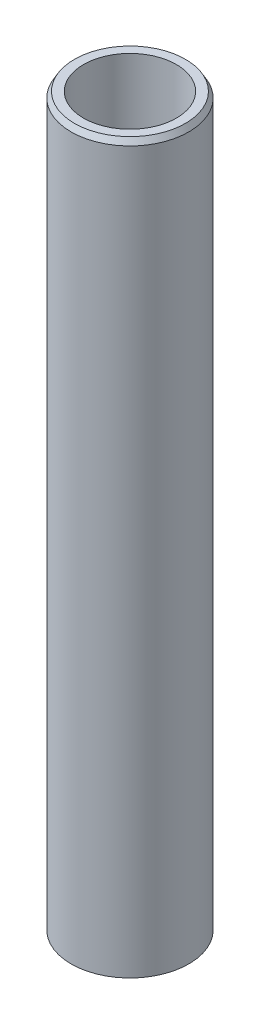
ISO-10303-21;
HEADER;
FILE_DESCRIPTION(('STEP AP214'),'2;1');
FILE_NAME('part.step','',(''),(''),'','','');
FILE_SCHEMA(('AUTOMOTIVE_DESIGN { 1 0 10303 214 1 1 1 1 }'));
ENDSEC;
DATA;
#1=APPLICATION_CONTEXT('core data for automotive mechanical design processes');
#2=APPLICATION_PROTOCOL_DEFINITION('international standard','automotive_design',2000,#1);
#3=PRODUCT_CONTEXT('',#1,'mechanical');
#4=PRODUCT('Part','Part','',(#3));
#5=PRODUCT_RELATED_PRODUCT_CATEGORY('part','',(#4));
#6=PRODUCT_DEFINITION_FORMATION('','',#4);
#7=PRODUCT_DEFINITION_CONTEXT('part definition',#1,'design');
#8=PRODUCT_DEFINITION('design','',#6,#7);
#9=PRODUCT_DEFINITION_SHAPE('','',#8);
#10=(LENGTH_UNIT() NAMED_UNIT(*) SI_UNIT(.MILLI.,.METRE.));
#11=(NAMED_UNIT(*) PLANE_ANGLE_UNIT() SI_UNIT($,.RADIAN.));
#12=(NAMED_UNIT(*) SI_UNIT($,.STERADIAN.) SOLID_ANGLE_UNIT());
#13=UNCERTAINTY_MEASURE_WITH_UNIT(LENGTH_MEASURE(1.E-05),#10,'distance_accuracy_value','');
#14=(GEOMETRIC_REPRESENTATION_CONTEXT(3) GLOBAL_UNCERTAINTY_ASSIGNED_CONTEXT((#13)) GLOBAL_UNIT_ASSIGNED_CONTEXT((#10,
#11,#12)) REPRESENTATION_CONTEXT('',''));
#15=CARTESIAN_POINT('',(0.,0.,0.));
#16=DIRECTION('',(0.,0.,1.));
#17=DIRECTION('',(1.,0.,0.));
#18=AXIS2_PLACEMENT_3D('',#15,#16,#17);
#19=CARTESIAN_POINT('',(0.,403.028937899505,0.));
#20=DIRECTION('',(0.,-1.,0.));
#21=DIRECTION('',(0.,0.,-1.));
#22=AXIS2_PLACEMENT_3D('',#19,#20,#21);
#23=CYLINDRICAL_SURFACE('',#22,32.5);
#24=CARTESIAN_POINT('',(0.,399.853276000623,0.));
#25=DIRECTION('',(0.,1.,0.));
#26=DIRECTION('',(0.,0.,1.));
#27=AXIS2_PLACEMENT_3D('',#24,#25,#26);
#28=CIRCLE('',#27,32.5);
#29=CARTESIAN_POINT('',(0.,399.853276000623,32.5));
#30=VERTEX_POINT('',#29);
#31=EDGE_CURVE('E50',#30,#30,#28,.F.);
#32=ORIENTED_EDGE('',*,*,#31,.T.);
#33=EDGE_LOOP('',(#32));
#34=FACE_BOUND('',#33,.T.);
#35=CARTESIAN_POINT('',(0.,1.83346925217448,0.));
#36=DIRECTION('',(0.,1.,0.));
#37=DIRECTION('',(0.,0.,1.));
#38=AXIS2_PLACEMENT_3D('',#35,#36,#37);
#39=CIRCLE('',#38,32.5);
#40=CARTESIAN_POINT('',(0.,1.83346925217448,32.5));
#41=VERTEX_POINT('',#40);
#42=EDGE_CURVE('E51',#41,#41,#39,.T.);
#43=ORIENTED_EDGE('',*,*,#42,.T.);
#44=EDGE_LOOP('',(#43));
#45=FACE_BOUND('',#44,.T.);
#46=ADVANCED_FACE('F39',(#34,#45),#23,.T.);
#47=CARTESIAN_POINT('',(0.,403.028937899505,0.));
#48=DIRECTION('',(0.,1.,0.));
#49=DIRECTION('',(0.,0.,1.));
#50=AXIS2_PLACEMENT_3D('',#47,#48,#49);
#51=PLANE('',#50);
#52=CARTESIAN_POINT('',(0.,403.028937899505,0.));
#53=DIRECTION('',(0.,1.,0.));
#54=DIRECTION('',(0.,0.,1.));
#55=AXIS2_PLACEMENT_3D('',#52,#53,#54);
#56=CIRCLE('',#55,30.6665307478255);
#57=CARTESIAN_POINT('',(0.,403.028937899505,30.6665307478255));
#58=VERTEX_POINT('',#57);
#59=EDGE_CURVE('E54',#58,#58,#56,.T.);
#60=ORIENTED_EDGE('',*,*,#59,.T.);
#61=EDGE_LOOP('',(#60));
#62=FACE_BOUND('',#61,.T.);
#63=CARTESIAN_POINT('',(0.,403.028937899505,0.));
#64=DIRECTION('',(0.,1.,0.));
#65=DIRECTION('',(0.,0.,1.));
#66=AXIS2_PLACEMENT_3D('',#63,#64,#65);
#67=CIRCLE('',#66,25.6666745850735);
#68=CARTESIAN_POINT('',(0.,403.028937899505,25.6666745850735));
#69=VERTEX_POINT('',#68);
#70=EDGE_CURVE('E58',#69,#69,#67,.T.);
#71=ORIENTED_EDGE('',*,*,#70,.F.);
#72=EDGE_LOOP('',(#71));
#73=FACE_BOUND('',#72,.T.);
#74=ADVANCED_FACE('F69',(#62,#73),#51,.T.);
#75=CARTESIAN_POINT('',(0.,0.,0.));
#76=DIRECTION('',(0.,1.,0.));
#77=DIRECTION('',(0.,0.,1.));
#78=AXIS2_PLACEMENT_3D('',#75,#76,#77);
#79=PLANE('',#78);
#80=CARTESIAN_POINT('',(0.,0.,0.));
#81=DIRECTION('',(0.,1.,0.));
#82=DIRECTION('',(0.,0.,1.));
#83=AXIS2_PLACEMENT_3D('',#80,#81,#82);
#84=CIRCLE('',#83,29.3243381011185);
#85=CARTESIAN_POINT('',(0.,0.,29.3243381011185));
#86=VERTEX_POINT('',#85);
#87=EDGE_CURVE('E10',#86,#86,#84,.F.);
#88=ORIENTED_EDGE('',*,*,#87,.T.);
#89=EDGE_LOOP('',(#88));
#90=FACE_BOUND('',#89,.T.);
#91=CARTESIAN_POINT('',(0.,0.,0.));
#92=DIRECTION('',(0.,1.,0.));
#93=DIRECTION('',(0.,0.,1.));
#94=AXIS2_PLACEMENT_3D('',#91,#92,#93);
#95=CIRCLE('',#94,25.6666745850735);
#96=CARTESIAN_POINT('',(0.,0.,25.6666745850735));
#97=VERTEX_POINT('',#96);
#98=EDGE_CURVE('E63',#97,#97,#95,.T.);
#99=ORIENTED_EDGE('',*,*,#98,.T.);
#100=EDGE_LOOP('',(#99));
#101=FACE_BOUND('',#100,.T.);
#102=ADVANCED_FACE('F75',(#90,#101),#79,.F.);
#103=CARTESIAN_POINT('',(0.,403.028937899505,0.));
#104=DIRECTION('',(0.,-1.,0.));
#105=DIRECTION('',(0.,0.,-1.));
#106=AXIS2_PLACEMENT_3D('',#103,#104,#105);
#107=CYLINDRICAL_SURFACE('',#106,25.6666745850735);
#108=ORIENTED_EDGE('',*,*,#70,.T.);
#109=EDGE_LOOP('',(#108));
#110=FACE_BOUND('',#109,.T.);
#111=ORIENTED_EDGE('',*,*,#98,.F.);
#112=EDGE_LOOP('',(#111));
#113=FACE_BOUND('',#112,.T.);
#114=ADVANCED_FACE('F70',(#110,#113),#107,.F.);
#115=CARTESIAN_POINT('',(0.,403.028937899505,0.));
#116=DIRECTION('',(0.,-1.,0.));
#117=DIRECTION('',(0.,0.,-1.));
#118=AXIS2_PLACEMENT_3D('',#115,#116,#117);
#119=CONICAL_SURFACE('',#118,30.6665307478255,0.523598775598284);
#120=ORIENTED_EDGE('',*,*,#31,.F.);
#121=EDGE_LOOP('',(#120));
#122=FACE_BOUND('',#121,.T.);
#123=ORIENTED_EDGE('',*,*,#59,.F.);
#124=EDGE_LOOP('',(#123));
#125=FACE_BOUND('',#124,.T.);
#126=ADVANCED_FACE('F81',(#122,#125),#119,.T.);
#127=CARTESIAN_POINT('',(0.,1.83346925217448,0.));
#128=DIRECTION('',(0.,1.,0.));
#129=DIRECTION('',(0.,0.,1.));
#130=AXIS2_PLACEMENT_3D('',#127,#128,#129);
#131=CONICAL_SURFACE('',#130,32.5,1.0471975511966);
#132=CARTESIAN_POINT('',(0.,0.,29.3243381011185));
#133=CARTESIAN_POINT('',(0.,0.0190986380434836,29.3574179125651));
#134=CARTESIAN_POINT('',(0.,0.0381972760869679,29.3904977240118));
#135=CARTESIAN_POINT('',(0.,0.0763945521739366,29.4566573469052));
#136=CARTESIAN_POINT('',(0.,0.095493190217421,29.4897371583519));
#137=CARTESIAN_POINT('',(0.,0.133690466304389,29.5558967812452));
#138=CARTESIAN_POINT('',(0.,0.152789104347873,29.5889765926919));
#139=CARTESIAN_POINT('',(0.,0.190986380434841,29.6551362155853));
#140=CARTESIAN_POINT('',(0.,0.210085018478326,29.688216027032));
#141=CARTESIAN_POINT('',(0.,0.248282294565294,29.7543756499253));
#142=CARTESIAN_POINT('',(0.,0.267380932608778,29.787455461372));
#143=CARTESIAN_POINT('',(0.,0.305578208695746,29.8536150842654));
#144=CARTESIAN_POINT('',(0.,0.324676846739231,29.8866948957121));
#145=CARTESIAN_POINT('',(0.,0.362874122826199,29.9528545186054));
#146=CARTESIAN_POINT('',(0.,0.381972760869683,29.9859343300521));
#147=CARTESIAN_POINT('',(0.,0.420170036956652,30.0520939529455));
#148=CARTESIAN_POINT('',(0.,0.439268675000135,30.0851737643922));
#149=CARTESIAN_POINT('',(0.,0.477465951087104,30.1513333872855));
#150=CARTESIAN_POINT('',(0.,0.496564589130588,30.1844131987322));
#151=CARTESIAN_POINT('',(0.,0.534761865217557,30.2505728216256));
#152=CARTESIAN_POINT('',(0.,0.553860503261041,30.2836526330723));
#153=CARTESIAN_POINT('',(0.,0.592057779348009,30.3498122559656));
#154=CARTESIAN_POINT('',(0.,0.611156417391493,30.3828920674123));
#155=CARTESIAN_POINT('',(0.,0.649353693478461,30.4490516903057));
#156=CARTESIAN_POINT('',(0.,0.668452331521946,30.4821315017523));
#157=CARTESIAN_POINT('',(0.,0.706649607608914,30.5482911246457));
#158=CARTESIAN_POINT('',(0.,0.725748245652398,30.5813709360924));
#159=CARTESIAN_POINT('',(0.,0.763945521739366,30.6475305589858));
#160=CARTESIAN_POINT('',(0.,0.783044159782851,30.6806103704324));
#161=CARTESIAN_POINT('',(0.,0.821241435869819,30.7467699933258));
#162=CARTESIAN_POINT('',(0.,0.840340073913303,30.7798498047725));
#163=CARTESIAN_POINT('',(0.,0.878537350000271,30.8460094276659));
#164=CARTESIAN_POINT('',(0.,0.897635988043756,30.8790892391125));
#165=CARTESIAN_POINT('',(0.,0.935833264130724,30.9452488620059));
#166=CARTESIAN_POINT('',(0.,0.954931902174208,30.9783286734526));
#167=CARTESIAN_POINT('',(0.,0.993129178261177,31.044488296346));
#168=CARTESIAN_POINT('',(0.,1.01222781630466,31.0775681077926));
#169=CARTESIAN_POINT('',(0.,1.05042509239163,31.143727730686));
#170=CARTESIAN_POINT('',(0.,1.06952373043511,31.1768075421327));
#171=CARTESIAN_POINT('',(0.,1.10772100652208,31.2429671650261));
#172=CARTESIAN_POINT('',(0.,1.12681964456557,31.2760469764727));
#173=CARTESIAN_POINT('',(0.,1.16501692065253,31.3422065993661));
#174=CARTESIAN_POINT('',(0.,1.18411555869602,31.3752864108128));
#175=CARTESIAN_POINT('',(0.,1.22231283478299,31.4414460337062));
#176=CARTESIAN_POINT('',(0.,1.24141147282647,31.4745258451528));
#177=CARTESIAN_POINT('',(0.,1.27960874891344,31.5406854680462));
#178=CARTESIAN_POINT('',(0.,1.29870738695692,31.5737652794929));
#179=CARTESIAN_POINT('',(0.,1.33690466304389,31.6399249023862));
#180=CARTESIAN_POINT('',(0.,1.35600330108738,31.6730047138329));
#181=CARTESIAN_POINT('',(0.,1.39420057717434,31.7391643367263));
#182=CARTESIAN_POINT('',(0.,1.41329921521783,31.772244148173));
#183=CARTESIAN_POINT('',(0.,1.4514964913048,31.8384037710663));
#184=CARTESIAN_POINT('',(0.,1.47059512934828,31.871483582513));
#185=CARTESIAN_POINT('',(0.,1.50879240543525,31.9376432054064));
#186=CARTESIAN_POINT('',(0.,1.52789104347873,31.9707230168531));
#187=CARTESIAN_POINT('',(0.,1.5660883195657,32.0368826397464));
#188=CARTESIAN_POINT('',(0.,1.58518695760919,32.0699624511931));
#189=CARTESIAN_POINT('',(0.,1.62338423369615,32.1361220740865));
#190=CARTESIAN_POINT('',(0.,1.64248287173964,32.1692018855332));
#191=CARTESIAN_POINT('',(0.,1.68068014782661,32.2353615084265));
#192=CARTESIAN_POINT('',(0.,1.69977878587009,32.2684413198732));
#193=CARTESIAN_POINT('',(0.,1.73797606195706,32.3346009427666));
#194=CARTESIAN_POINT('',(0.,1.75707470000054,32.3676807542133));
#195=CARTESIAN_POINT('',(0.,1.79527197608751,32.4338403771066));
#196=CARTESIAN_POINT('',(0.,1.814370614131,32.4669201885533));
#197=CARTESIAN_POINT('',(0.,1.83346925217448,32.5));
#198=B_SPLINE_CURVE_WITH_KNOTS('',3,(#132,#133,#134,#135,#136,#137,#138,#139,#140,#141,#142,
#143,#144,#145,#146,#147,#148,#149,#150,#151,#152,#153,#154,#155,#156,#157,#158,#159,#160,#161,
#162,#163,#164,#165,#166,#167,#168,#169,#170,#171,#172,#173,#174,#175,#176,#177,#178,#179,#180,
#181,#182,#183,#184,#185,#186,#187,#188,#189,#190,#191,#192,#193,#194,#195,#196,#197),
.UNSPECIFIED.,.F.,.F.,(4,2,2,2,2,2,2,2,2,2,2,2,2,2,2,2,2,2,2,2,2,2,2,2,2,2,2,2,2,2,2,2,4),(0.,
0.114591828260905,0.22918365652181,0.343775484782719,0.458367313043624,0.572959141304529,
0.687550969565434,0.802142797826339,0.916734626087248,1.03132645434815,1.14591828260906,
1.26051011086997,1.37510193913087,1.48969376739178,1.60428559565268,1.71887742391359,
1.8334692521745,1.9480610804354,2.06265290869631,2.17724473695721,2.29183656521812,
2.40642839347902,2.52102022173993,2.63561205000084,2.75020387826174,2.86479570652265,
2.97938753478355,3.09397936304446,3.20857119130536,3.32316301956627,3.43775484782718,
3.55234667608808,3.66693850434899),.UNSPECIFIED.);
#199=EDGE_CURVE('BSEAM45',#86,#41,#198,.T.);
#200=ORIENTED_EDGE('',*,*,#87,.F.);
#201=ORIENTED_EDGE('',*,*,#42,.F.);
#202=ORIENTED_EDGE('',*,*,#199,.T.);
#203=ORIENTED_EDGE('',*,*,#199,.F.);
#204=EDGE_LOOP('',(#200,#202,#201,#203));
#205=FACE_BOUND('',#204,.T.);
#206=ADVANCED_FACE('F45',(#205),#131,.T.);
#207=CLOSED_SHELL('',(#46,#74,#102,#114,#126,#206));
#208=MANIFOLD_SOLID_BREP('B2',#207);
#209=ADVANCED_BREP_SHAPE_REPRESENTATION('',(#18,#208),#14);
#210=SHAPE_DEFINITION_REPRESENTATION(#9,#209);
ENDSEC;
END-ISO-10303-21;
